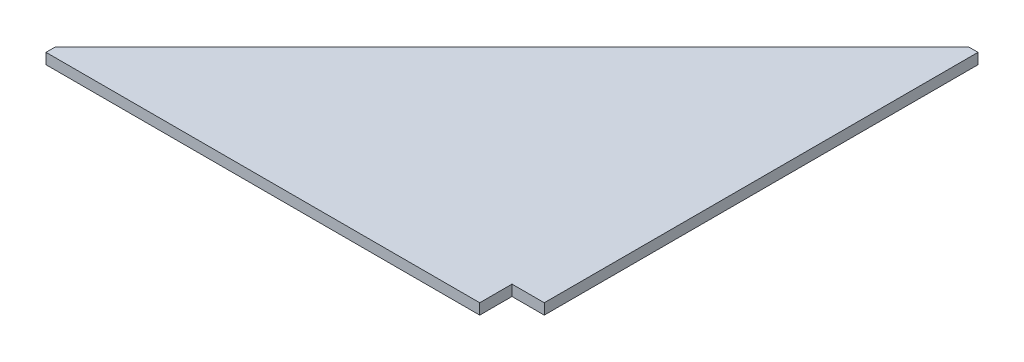
ISO-10303-21;
HEADER;
FILE_DESCRIPTION(('STEP AP214'),'2;1');
FILE_NAME('part.step','',(''),(''),'','','');
FILE_SCHEMA(('AUTOMOTIVE_DESIGN { 1 0 10303 214 1 1 1 1 }'));
ENDSEC;
DATA;
#1=APPLICATION_CONTEXT('core data for automotive mechanical design processes');
#2=APPLICATION_PROTOCOL_DEFINITION('international standard','automotive_design',2000,#1);
#3=PRODUCT_CONTEXT('',#1,'mechanical');
#4=PRODUCT('Part','Part','',(#3));
#5=PRODUCT_RELATED_PRODUCT_CATEGORY('part','',(#4));
#6=PRODUCT_DEFINITION_FORMATION('','',#4);
#7=PRODUCT_DEFINITION_CONTEXT('part definition',#1,'design');
#8=PRODUCT_DEFINITION('design','',#6,#7);
#9=PRODUCT_DEFINITION_SHAPE('','',#8);
#10=(LENGTH_UNIT() NAMED_UNIT(*) SI_UNIT(.MILLI.,.METRE.));
#11=(NAMED_UNIT(*) PLANE_ANGLE_UNIT() SI_UNIT($,.RADIAN.));
#12=(NAMED_UNIT(*) SI_UNIT($,.STERADIAN.) SOLID_ANGLE_UNIT());
#13=UNCERTAINTY_MEASURE_WITH_UNIT(LENGTH_MEASURE(1.E-05),#10,'distance_accuracy_value','');
#14=(GEOMETRIC_REPRESENTATION_CONTEXT(3) GLOBAL_UNCERTAINTY_ASSIGNED_CONTEXT((#13)) GLOBAL_UNIT_ASSIGNED_CONTEXT((#10,
#11,#12)) REPRESENTATION_CONTEXT('',''));
#15=CARTESIAN_POINT('',(0.,0.,0.));
#16=DIRECTION('',(0.,0.,1.));
#17=DIRECTION('',(1.,0.,0.));
#18=AXIS2_PLACEMENT_3D('',#15,#16,#17);
#19=CARTESIAN_POINT('',(0.,12.7,-550.1));
#20=DIRECTION('',(0.,0.,1.));
#21=DIRECTION('',(1.,0.,0.));
#22=AXIS2_PLACEMENT_3D('',#19,#20,#21);
#23=PLANE('',#22);
#24=DIRECTION('',(-1.,0.,0.));
#25=VECTOR('',#24,1.);
#26=CARTESIAN_POINT('',(0.,0.,-550.1));
#27=LINE('',#26,#25);
#28=CARTESIAN_POINT('',(0.,0.,-550.1));
#29=VERTEX_POINT('',#28);
#30=CARTESIAN_POINT('',(-11.2,0.,-550.1));
#31=VERTEX_POINT('',#30);
#32=EDGE_CURVE('E125',#29,#31,#27,.T.);
#33=ORIENTED_EDGE('',*,*,#32,.T.);
#34=DIRECTION('',(0.,-1.,0.));
#35=VECTOR('',#34,1.);
#36=CARTESIAN_POINT('',(-11.2,12.7,-550.1));
#37=LINE('',#36,#35);
#38=CARTESIAN_POINT('',(-11.2,12.7,-550.1));
#39=VERTEX_POINT('',#38);
#40=EDGE_CURVE('E11',#39,#31,#37,.T.);
#41=ORIENTED_EDGE('',*,*,#40,.F.);
#42=DIRECTION('',(-1.,0.,0.));
#43=VECTOR('',#42,1.);
#44=CARTESIAN_POINT('',(0.,12.7,-550.1));
#45=LINE('',#44,#43);
#46=CARTESIAN_POINT('',(0.,12.7,-550.1));
#47=VERTEX_POINT('',#46);
#48=EDGE_CURVE('E137',#47,#39,#45,.T.);
#49=ORIENTED_EDGE('',*,*,#48,.F.);
#50=DIRECTION('',(0.,-1.,0.));
#51=VECTOR('',#50,1.);
#52=CARTESIAN_POINT('',(0.,12.7,-550.1));
#53=LINE('',#52,#51);
#54=EDGE_CURVE('E121',#47,#29,#53,.T.);
#55=ORIENTED_EDGE('',*,*,#54,.T.);
#56=EDGE_LOOP('',(#33,#41,#49,#55));
#57=FACE_BOUND('',#56,.T.);
#58=ADVANCED_FACE('F35',(#57),#23,.F.);
#59=CARTESIAN_POINT('',(-11.2,12.7,-550.1));
#60=DIRECTION('',(0.707106781186548,0.,0.707106781186547));
#61=DIRECTION('',(0.707106781186547,0.,-0.707106781186548));
#62=AXIS2_PLACEMENT_3D('',#59,#60,#61);
#63=PLANE('',#62);
#64=DIRECTION('',(-0.707106781186547,0.,0.707106781186548));
#65=VECTOR('',#64,1.);
#66=CARTESIAN_POINT('',(-11.2,0.,-550.1));
#67=LINE('',#66,#65);
#68=CARTESIAN_POINT('',(-550.1,0.,-11.1999999999999));
#69=VERTEX_POINT('',#68);
#70=EDGE_CURVE('E128',#31,#69,#67,.T.);
#71=ORIENTED_EDGE('',*,*,#70,.T.);
#72=DIRECTION('',(0.,-1.,0.));
#73=VECTOR('',#72,1.);
#74=CARTESIAN_POINT('',(-550.1,12.7,-11.1999999999999));
#75=LINE('',#74,#73);
#76=CARTESIAN_POINT('',(-550.1,12.7,-11.1999999999999));
#77=VERTEX_POINT('',#76);
#78=EDGE_CURVE('E43',#77,#69,#75,.T.);
#79=ORIENTED_EDGE('',*,*,#78,.F.);
#80=DIRECTION('',(-0.707106781186547,0.,0.707106781186548));
#81=VECTOR('',#80,1.);
#82=CARTESIAN_POINT('',(-11.2,12.7,-550.1));
#83=LINE('',#82,#81);
#84=EDGE_CURVE('E91',#39,#77,#83,.T.);
#85=ORIENTED_EDGE('',*,*,#84,.F.);
#86=ORIENTED_EDGE('',*,*,#40,.T.);
#87=EDGE_LOOP('',(#71,#79,#85,#86));
#88=FACE_BOUND('',#87,.T.);
#89=ADVANCED_FACE('F162',(#88),#63,.F.);
#90=CARTESIAN_POINT('',(-550.1,12.7,-11.1999999999999));
#91=DIRECTION('',(1.,0.,0.));
#92=DIRECTION('',(0.,0.,-1.));
#93=AXIS2_PLACEMENT_3D('',#90,#91,#92);
#94=PLANE('',#93);
#95=DIRECTION('',(0.,0.,1.));
#96=VECTOR('',#95,1.);
#97=CARTESIAN_POINT('',(-550.1,0.,-11.1999999999999));
#98=LINE('',#97,#96);
#99=CARTESIAN_POINT('',(-550.1,0.,0.));
#100=VERTEX_POINT('',#99);
#101=EDGE_CURVE('E130',#69,#100,#98,.T.);
#102=ORIENTED_EDGE('',*,*,#101,.T.);
#103=DIRECTION('',(0.,-1.,0.));
#104=VECTOR('',#103,1.);
#105=CARTESIAN_POINT('',(-550.1,12.7,0.));
#106=LINE('',#105,#104);
#107=CARTESIAN_POINT('',(-550.1,12.7,0.));
#108=VERTEX_POINT('',#107);
#109=EDGE_CURVE('E141',#108,#100,#106,.T.);
#110=ORIENTED_EDGE('',*,*,#109,.F.);
#111=DIRECTION('',(0.,0.,1.));
#112=VECTOR('',#111,1.);
#113=CARTESIAN_POINT('',(-550.1,12.7,-11.1999999999999));
#114=LINE('',#113,#112);
#115=EDGE_CURVE('E149',#77,#108,#114,.T.);
#116=ORIENTED_EDGE('',*,*,#115,.F.);
#117=ORIENTED_EDGE('',*,*,#78,.T.);
#118=EDGE_LOOP('',(#102,#110,#116,#117));
#119=FACE_BOUND('',#118,.T.);
#120=ADVANCED_FACE('F147',(#119),#94,.F.);
#121=CARTESIAN_POINT('',(-550.1,12.7,0.));
#122=DIRECTION('',(0.,0.,-1.));
#123=DIRECTION('',(-1.,0.,0.));
#124=AXIS2_PLACEMENT_3D('',#121,#122,#123);
#125=PLANE('',#124);
#126=DIRECTION('',(1.,0.,0.));
#127=VECTOR('',#126,1.);
#128=CARTESIAN_POINT('',(-550.1,0.,0.));
#129=LINE('',#128,#127);
#130=CARTESIAN_POINT('',(-38.1,0.,0.));
#131=VERTEX_POINT('',#130);
#132=EDGE_CURVE('E132',#100,#131,#129,.T.);
#133=ORIENTED_EDGE('',*,*,#132,.T.);
#134=DIRECTION('',(0.,-1.,0.));
#135=VECTOR('',#134,1.);
#136=CARTESIAN_POINT('',(-38.1,12.7,0.));
#137=LINE('',#136,#135);
#138=CARTESIAN_POINT('',(-38.1,12.7,0.));
#139=VERTEX_POINT('',#138);
#140=EDGE_CURVE('E116',#139,#131,#137,.T.);
#141=ORIENTED_EDGE('',*,*,#140,.F.);
#142=DIRECTION('',(1.,0.,0.));
#143=VECTOR('',#142,1.);
#144=CARTESIAN_POINT('',(-550.1,12.7,0.));
#145=LINE('',#144,#143);
#146=EDGE_CURVE('E107',#108,#139,#145,.T.);
#147=ORIENTED_EDGE('',*,*,#146,.F.);
#148=ORIENTED_EDGE('',*,*,#109,.T.);
#149=EDGE_LOOP('',(#133,#141,#147,#148));
#150=FACE_BOUND('',#149,.T.);
#151=ADVANCED_FACE('F155',(#150),#125,.F.);
#152=CARTESIAN_POINT('',(-38.1,12.7,0.));
#153=DIRECTION('',(-1.,0.,0.));
#154=DIRECTION('',(0.,0.,1.));
#155=AXIS2_PLACEMENT_3D('',#152,#153,#154);
#156=PLANE('',#155);
#157=DIRECTION('',(0.,0.,-1.));
#158=VECTOR('',#157,1.);
#159=CARTESIAN_POINT('',(-38.1,0.,0.));
#160=LINE('',#159,#158);
#161=CARTESIAN_POINT('',(-38.1,0.,-38.1));
#162=VERTEX_POINT('',#161);
#163=EDGE_CURVE('E115',#131,#162,#160,.T.);
#164=ORIENTED_EDGE('',*,*,#163,.T.);
#165=DIRECTION('',(0.,-1.,0.));
#166=VECTOR('',#165,1.);
#167=CARTESIAN_POINT('',(-38.1,12.7,-38.1));
#168=LINE('',#167,#166);
#169=CARTESIAN_POINT('',(-38.1,12.7,-38.1));
#170=VERTEX_POINT('',#169);
#171=EDGE_CURVE('E112',#170,#162,#168,.T.);
#172=ORIENTED_EDGE('',*,*,#171,.F.);
#173=DIRECTION('',(0.,0.,-1.));
#174=VECTOR('',#173,1.);
#175=CARTESIAN_POINT('',(-38.1,12.7,0.));
#176=LINE('',#175,#174);
#177=EDGE_CURVE('E101',#139,#170,#176,.T.);
#178=ORIENTED_EDGE('',*,*,#177,.F.);
#179=ORIENTED_EDGE('',*,*,#140,.T.);
#180=EDGE_LOOP('',(#164,#172,#178,#179));
#181=FACE_BOUND('',#180,.T.);
#182=ADVANCED_FACE('F113',(#181),#156,.F.);
#183=CARTESIAN_POINT('',(-38.1,12.7,-38.1));
#184=DIRECTION('',(0.,0.,-1.));
#185=DIRECTION('',(-1.,0.,0.));
#186=AXIS2_PLACEMENT_3D('',#183,#184,#185);
#187=PLANE('',#186);
#188=DIRECTION('',(1.,0.,0.));
#189=VECTOR('',#188,1.);
#190=CARTESIAN_POINT('',(-38.1,0.,-38.1));
#191=LINE('',#190,#189);
#192=CARTESIAN_POINT('',(0.,0.,-38.1));
#193=VERTEX_POINT('',#192);
#194=EDGE_CURVE('E77',#162,#193,#191,.T.);
#195=ORIENTED_EDGE('',*,*,#194,.T.);
#196=DIRECTION('',(0.,-1.,0.));
#197=VECTOR('',#196,1.);
#198=CARTESIAN_POINT('',(0.,12.7,-38.1));
#199=LINE('',#198,#197);
#200=CARTESIAN_POINT('',(0.,12.7,-38.1));
#201=VERTEX_POINT('',#200);
#202=EDGE_CURVE('E117',#201,#193,#199,.T.);
#203=ORIENTED_EDGE('',*,*,#202,.F.);
#204=DIRECTION('',(1.,0.,0.));
#205=VECTOR('',#204,1.);
#206=CARTESIAN_POINT('',(-38.1,12.7,-38.1));
#207=LINE('',#206,#205);
#208=EDGE_CURVE('E105',#170,#201,#207,.T.);
#209=ORIENTED_EDGE('',*,*,#208,.F.);
#210=ORIENTED_EDGE('',*,*,#171,.T.);
#211=EDGE_LOOP('',(#195,#203,#209,#210));
#212=FACE_BOUND('',#211,.T.);
#213=ADVANCED_FACE('F119',(#212),#187,.F.);
#214=CARTESIAN_POINT('',(0.,12.7,-38.1));
#215=DIRECTION('',(-1.,0.,0.));
#216=DIRECTION('',(0.,0.,1.));
#217=AXIS2_PLACEMENT_3D('',#214,#215,#216);
#218=PLANE('',#217);
#219=DIRECTION('',(0.,0.,-1.));
#220=VECTOR('',#219,1.);
#221=CARTESIAN_POINT('',(0.,0.,-38.1));
#222=LINE('',#221,#220);
#223=EDGE_CURVE('E83',#193,#29,#222,.T.);
#224=ORIENTED_EDGE('',*,*,#223,.T.);
#225=ORIENTED_EDGE('',*,*,#54,.F.);
#226=DIRECTION('',(0.,0.,-1.));
#227=VECTOR('',#226,1.);
#228=CARTESIAN_POINT('',(0.,12.7,-38.1));
#229=LINE('',#228,#227);
#230=EDGE_CURVE('E51',#201,#47,#229,.T.);
#231=ORIENTED_EDGE('',*,*,#230,.F.);
#232=ORIENTED_EDGE('',*,*,#202,.T.);
#233=EDGE_LOOP('',(#224,#225,#231,#232));
#234=FACE_BOUND('',#233,.T.);
#235=ADVANCED_FACE('F176',(#234),#218,.F.);
#236=CARTESIAN_POINT('',(0.,12.7,0.));
#237=DIRECTION('',(0.,1.,0.));
#238=DIRECTION('',(0.,0.,1.));
#239=AXIS2_PLACEMENT_3D('',#236,#237,#238);
#240=PLANE('',#239);
#241=ORIENTED_EDGE('',*,*,#48,.T.);
#242=ORIENTED_EDGE('',*,*,#84,.T.);
#243=ORIENTED_EDGE('',*,*,#115,.T.);
#244=ORIENTED_EDGE('',*,*,#146,.T.);
#245=ORIENTED_EDGE('',*,*,#177,.T.);
#246=ORIENTED_EDGE('',*,*,#208,.T.);
#247=ORIENTED_EDGE('',*,*,#230,.T.);
#248=EDGE_LOOP('',(#241,#242,#243,#244,#245,#246,#247));
#249=FACE_BOUND('',#248,.T.);
#250=ADVANCED_FACE('F103',(#249),#240,.T.);
#251=CARTESIAN_POINT('',(0.,0.,0.));
#252=DIRECTION('',(0.,1.,0.));
#253=DIRECTION('',(0.,0.,1.));
#254=AXIS2_PLACEMENT_3D('',#251,#252,#253);
#255=PLANE('',#254);
#256=ORIENTED_EDGE('',*,*,#32,.F.);
#257=ORIENTED_EDGE('',*,*,#223,.F.);
#258=ORIENTED_EDGE('',*,*,#194,.F.);
#259=ORIENTED_EDGE('',*,*,#163,.F.);
#260=ORIENTED_EDGE('',*,*,#132,.F.);
#261=ORIENTED_EDGE('',*,*,#101,.F.);
#262=ORIENTED_EDGE('',*,*,#70,.F.);
#263=EDGE_LOOP('',(#256,#257,#258,#259,#260,#261,#262));
#264=FACE_BOUND('',#263,.T.);
#265=ADVANCED_FACE('F153',(#264),#255,.F.);
#266=CLOSED_SHELL('',(#58,#89,#120,#151,#182,#213,#235,#250,#265));
#267=MANIFOLD_SOLID_BREP('B2',#266);
#268=ADVANCED_BREP_SHAPE_REPRESENTATION('',(#18,#267),#14);
#269=SHAPE_DEFINITION_REPRESENTATION(#9,#268);
ENDSEC;
END-ISO-10303-21;
